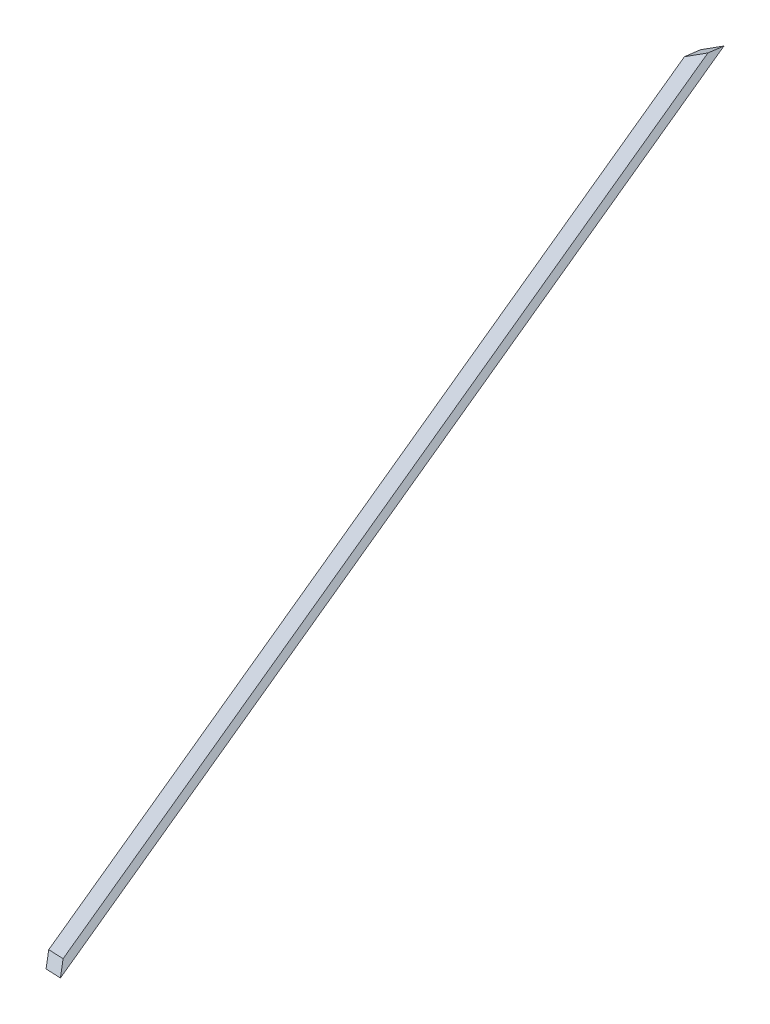
ISO-10303-21;
HEADER;
FILE_DESCRIPTION(('STEP AP214'),'2;1');
FILE_NAME('part.step','',(''),(''),'','','');
FILE_SCHEMA(('AUTOMOTIVE_DESIGN { 1 0 10303 214 1 1 1 1 }'));
ENDSEC;
DATA;
#1=APPLICATION_CONTEXT('core data for automotive mechanical design processes');
#2=APPLICATION_PROTOCOL_DEFINITION('international standard','automotive_design',2000,#1);
#3=PRODUCT_CONTEXT('',#1,'mechanical');
#4=PRODUCT('Part','Part','',(#3));
#5=PRODUCT_RELATED_PRODUCT_CATEGORY('part','',(#4));
#6=PRODUCT_DEFINITION_FORMATION('','',#4);
#7=PRODUCT_DEFINITION_CONTEXT('part definition',#1,'design');
#8=PRODUCT_DEFINITION('design','',#6,#7);
#9=PRODUCT_DEFINITION_SHAPE('','',#8);
#10=(LENGTH_UNIT() NAMED_UNIT(*) SI_UNIT(.MILLI.,.METRE.));
#11=(NAMED_UNIT(*) PLANE_ANGLE_UNIT() SI_UNIT($,.RADIAN.));
#12=(NAMED_UNIT(*) SI_UNIT($,.STERADIAN.) SOLID_ANGLE_UNIT());
#13=UNCERTAINTY_MEASURE_WITH_UNIT(LENGTH_MEASURE(1.E-05),#10,'distance_accuracy_value','');
#14=(GEOMETRIC_REPRESENTATION_CONTEXT(3) GLOBAL_UNCERTAINTY_ASSIGNED_CONTEXT((#13)) GLOBAL_UNIT_ASSIGNED_CONTEXT((#10,
#11,#12)) REPRESENTATION_CONTEXT('',''));
#15=CARTESIAN_POINT('',(0.,0.,0.));
#16=DIRECTION('',(0.,0.,1.));
#17=DIRECTION('',(1.,0.,0.));
#18=AXIS2_PLACEMENT_3D('',#15,#16,#17);
#19=CARTESIAN_POINT('',(-11.8087000621666,18.5032324543102,11.595270236108));
#20=DIRECTION('',(0.475683661041611,-0.745355992499932,-0.467086179481358));
#21=DIRECTION('',(0.842960923517798,0.537974796270254,0.));
#22=AXIS2_PLACEMENT_3D('',#19,#20,#21);
#23=PLANE('',#22);
#24=DIRECTION('',(0.842960923517797,0.537974796270256,0.));
#25=VECTOR('',#24,1.);
#26=CARTESIAN_POINT('',(-1.46530917941471,2.2960153294955,47.9918265788729));
#27=LINE('',#26,#25);
#28=CARTESIAN_POINT('',(6228.00445086952,3977.92244300361,47.9918265768247));
#29=VERTEX_POINT('',#28);
#30=CARTESIAN_POINT('',(6314.76033140355,4033.28975108803,47.9918265768247));
#31=VERTEX_POINT('',#30);
#32=EDGE_CURVE('E12',#29,#31,#27,.T.);
#33=ORIENTED_EDGE('',*,*,#32,.F.);
#34=DIRECTION('',(0.0720568497786003,-0.496206988023978,0.86520889699318));
#35=VECTOR('',#34,1.);
#36=CARTESIAN_POINT('',(6334.90652162389,3241.75988932849,1331.59807648117));
#37=LINE('',#36,#35);
#38=CARTESIAN_POINT('',(6441.67347031888,2506.52783026355,2613.58187399041));
#39=VERTEX_POINT('',#38);
#40=EDGE_CURVE('E107',#29,#39,#37,.T.);
#41=ORIENTED_EDGE('',*,*,#40,.T.);
#42=DIRECTION('',(-0.872677996249967,-0.333333333333336,-0.356822089773082));
#43=VECTOR('',#42,1.);
#44=CARTESIAN_POINT('',(-7.0676058958065,43.327923797101,-23.1905404722166));
#45=LINE('',#44,#43);
#46=CARTESIAN_POINT('',(6531.48777353876,2540.83384141765,2650.30530176577));
#47=VERTEX_POINT('',#46);
#48=EDGE_CURVE('E54',#47,#39,#45,.T.);
#49=ORIENTED_EDGE('',*,*,#48,.F.);
#50=DIRECTION('',(0.0720568497786005,-0.496206988023978,0.86520889699318));
#51=VECTOR('',#50,1.);
#52=CARTESIAN_POINT('',(6423.19161350084,3286.59654894776,1349.95979036885));
#53=LINE('',#52,#51);
#54=EDGE_CURVE('E62',#31,#47,#53,.T.);
#55=ORIENTED_EDGE('',*,*,#54,.F.);
#56=EDGE_LOOP('',(#33,#41,#49,#55));
#57=FACE_BOUND('',#56,.T.);
#58=ADVANCED_FACE('F45',(#57),#23,.F.);
#59=CARTESIAN_POINT('',(0.,0.,0.));
#60=DIRECTION('',(-0.537110456627946,0.841606576533205,-0.0566632836762697));
#61=DIRECTION('',(-0.842960923517797,-0.537974796270256,0.));
#62=AXIS2_PLACEMENT_3D('',#59,#60,#61);
#63=PLANE('',#62);
#64=ORIENTED_EDGE('',*,*,#32,.T.);
#65=DIRECTION('',(0.228891628224949,0.0807637152780898,-0.970095791570611));
#66=VECTOR('',#65,1.);
#67=CARTESIAN_POINT('',(5920.01781890113,3894.0060554145,1721.00212014798));
#68=LINE('',#67,#66);
#69=CARTESIAN_POINT('',(6326.08388050265,4037.28523096846,-1.55431223447522E-12));
#70=VERTEX_POINT('',#69);
#71=EDGE_CURVE('E114',#31,#70,#68,.T.);
#72=ORIENTED_EDGE('',*,*,#71,.T.);
#73=DIRECTION('',(-0.842960923517798,-0.537974796270254,0.));
#74=VECTOR('',#73,1.);
#75=CARTESIAN_POINT('',(0.,0.,0.));
#76=LINE('',#75,#74);
#77=CARTESIAN_POINT('',(6239.32799996861,3981.91792288404,-1.32401882040414E-12));
#78=VERTEX_POINT('',#77);
#79=EDGE_CURVE('E106',#70,#78,#76,.T.);
#80=ORIENTED_EDGE('',*,*,#79,.T.);
#81=DIRECTION('',(0.22889162822495,0.08076371527809,-0.970095791570611));
#82=VECTOR('',#81,1.);
#83=CARTESIAN_POINT('',(5838.83072616611,3840.60367717802,1697.40030626838));
#84=LINE('',#83,#82);
#85=EDGE_CURVE('E92',#29,#78,#84,.T.);
#86=ORIENTED_EDGE('',*,*,#85,.F.);
#87=EDGE_LOOP('',(#64,#72,#80,#86));
#88=FACE_BOUND('',#87,.T.);
#89=ADVANCED_FACE('F119',(#88),#63,.T.);
#90=CARTESIAN_POINT('',(0.,0.,0.));
#91=DIRECTION('',(-0.467086179481353,0.356822089773098,0.809016994374947));
#92=DIRECTION('',(0.866025403784441,0.,0.499999999999996));
#93=AXIS2_PLACEMENT_3D('',#90,#91,#92);
#94=PLANE('',#93);
#95=DIRECTION('',(0.872677996249967,0.333333333333332,0.356822089773087));
#96=VECTOR('',#95,1.);
#97=CARTESIAN_POINT('',(0.,0.,0.));
#98=LINE('',#97,#96);
#99=CARTESIAN_POINT('',(6459.28429782541,2467.22705877079,2641.08334516592));
#100=VERTEX_POINT('',#99);
#101=CARTESIAN_POINT('',(6549.09860104528,2501.5330699249,2677.80677294127));
#102=VERTEX_POINT('',#101);
#103=EDGE_CURVE('E49',#100,#102,#98,.T.);
#104=ORIENTED_EDGE('',*,*,#103,.T.);
#105=DIRECTION('',(-0.344646943269872,0.769122902265754,-0.538208552240706));
#106=VECTOR('',#105,1.);
#107=CARTESIAN_POINT('',(5937.5712141759,3866.23317183668,1722.83161366703));
#108=LINE('',#107,#106);
#109=EDGE_CURVE('E110',#102,#47,#108,.T.);
#110=ORIENTED_EDGE('',*,*,#109,.T.);
#111=ORIENTED_EDGE('',*,*,#48,.T.);
#112=DIRECTION('',(-0.344646943269872,0.769122902265754,-0.538208552240706));
#113=VECTOR('',#112,1.);
#114=CARTESIAN_POINT('',(5856.14339427188,3813.21167077718,1699.20471012309));
#115=LINE('',#114,#113);
#116=EDGE_CURVE('E90',#100,#39,#115,.T.);
#117=ORIENTED_EDGE('',*,*,#116,.F.);
#118=EDGE_LOOP('',(#104,#110,#111,#117));
#119=FACE_BOUND('',#118,.T.);
#120=ADVANCED_FACE('F101',(#119),#94,.T.);
#121=CARTESIAN_POINT('',(0.,0.,0.));
#122=DIRECTION('',(0.475683661041611,-0.745355992499932,-0.467086179481358));
#123=DIRECTION('',(0.842960923517798,0.537974796270254,0.));
#124=AXIS2_PLACEMENT_3D('',#121,#122,#123);
#125=PLANE('',#124);
#126=ORIENTED_EDGE('',*,*,#103,.F.);
#127=DIRECTION('',(-0.0720568497786001,0.496206988023978,-0.86520889699318));
#128=VECTOR('',#127,1.);
#129=CARTESIAN_POINT('',(6349.30614889701,3224.57249082742,1320.54167258296));
#130=LINE('',#129,#128);
#131=EDGE_CURVE('E87',#100,#78,#130,.T.);
#132=ORIENTED_EDGE('',*,*,#131,.T.);
#133=ORIENTED_EDGE('',*,*,#79,.F.);
#134=DIRECTION('',(0.072056849778606,-0.496206988023985,0.865208896993176));
#135=VECTOR('',#134,1.);
#136=CARTESIAN_POINT('',(6437.59124077395,3269.40915044669,1338.90338647064));
#137=LINE('',#136,#135);
#138=EDGE_CURVE('E97',#70,#102,#137,.T.);
#139=ORIENTED_EDGE('',*,*,#138,.T.);
#140=EDGE_LOOP('',(#126,#132,#133,#139));
#141=FACE_BOUND('',#140,.T.);
#142=ADVANCED_FACE('F105',(#141),#125,.T.);
#143=CARTESIAN_POINT('',(5856.14339427185,3813.2116707772,1699.20471012313));
#144=DIRECTION('',(-0.814278199040255,-0.530215010595009,-0.236269035439461));
#145=DIRECTION('',(0.545664026406652,-0.838004039540192,0.));
#146=AXIS2_PLACEMENT_3D('',#143,#144,#145);
#147=PLANE('',#146);
#148=ORIENTED_EDGE('',*,*,#40,.F.);
#149=ORIENTED_EDGE('',*,*,#85,.T.);
#150=ORIENTED_EDGE('',*,*,#131,.F.);
#151=ORIENTED_EDGE('',*,*,#116,.T.);
#152=EDGE_LOOP('',(#148,#149,#150,#151));
#153=FACE_BOUND('',#152,.T.);
#154=ADVANCED_FACE('F89',(#153),#147,.T.);
#155=CARTESIAN_POINT('',(5937.57121417588,3866.2331718367,1722.83161366707));
#156=DIRECTION('',(-0.814278199040255,-0.530215010595009,-0.23626903543946));
#157=DIRECTION('',(-0.529104719738801,0.845360491702084,-0.07357876473097));
#158=AXIS2_PLACEMENT_3D('',#155,#156,#157);
#159=PLANE('',#158);
#160=ORIENTED_EDGE('',*,*,#71,.F.);
#161=ORIENTED_EDGE('',*,*,#54,.T.);
#162=ORIENTED_EDGE('',*,*,#109,.F.);
#163=ORIENTED_EDGE('',*,*,#138,.F.);
#164=EDGE_LOOP('',(#160,#161,#162,#163));
#165=FACE_BOUND('',#164,.T.);
#166=ADVANCED_FACE('F47',(#165),#159,.F.);
#167=CLOSED_SHELL('',(#58,#89,#120,#142,#154,#166));
#168=MANIFOLD_SOLID_BREP('B2',#167);
#169=ADVANCED_BREP_SHAPE_REPRESENTATION('',(#18,#168),#14);
#170=SHAPE_DEFINITION_REPRESENTATION(#9,#169);
ENDSEC;
END-ISO-10303-21;
